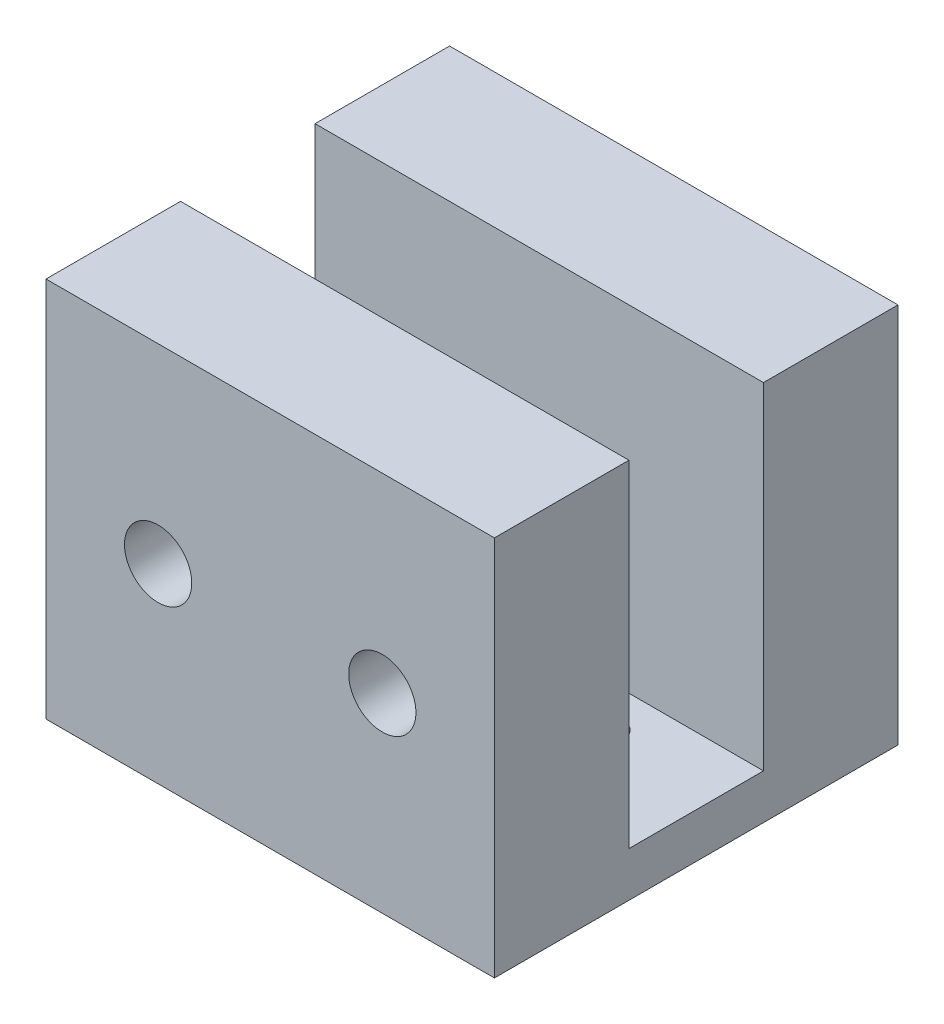
ISO-10303-21;
HEADER;
FILE_DESCRIPTION(('STEP AP214'),'2;1');
FILE_NAME('part.step','',(''),(''),'','','');
FILE_SCHEMA(('AUTOMOTIVE_DESIGN { 1 0 10303 214 1 1 1 1 }'));
ENDSEC;
DATA;
#1=APPLICATION_CONTEXT('core data for automotive mechanical design processes');
#2=APPLICATION_PROTOCOL_DEFINITION('international standard','automotive_design',2000,#1);
#3=PRODUCT_CONTEXT('',#1,'mechanical');
#4=PRODUCT('Part','Part','',(#3));
#5=PRODUCT_RELATED_PRODUCT_CATEGORY('part','',(#4));
#6=PRODUCT_DEFINITION_FORMATION('','',#4);
#7=PRODUCT_DEFINITION_CONTEXT('part definition',#1,'design');
#8=PRODUCT_DEFINITION('design','',#6,#7);
#9=PRODUCT_DEFINITION_SHAPE('','',#8);
#10=(LENGTH_UNIT() NAMED_UNIT(*) SI_UNIT(.MILLI.,.METRE.));
#11=(NAMED_UNIT(*) PLANE_ANGLE_UNIT() SI_UNIT($,.RADIAN.));
#12=(NAMED_UNIT(*) SI_UNIT($,.STERADIAN.) SOLID_ANGLE_UNIT());
#13=UNCERTAINTY_MEASURE_WITH_UNIT(LENGTH_MEASURE(1.E-05),#10,'distance_accuracy_value','');
#14=(GEOMETRIC_REPRESENTATION_CONTEXT(3) GLOBAL_UNCERTAINTY_ASSIGNED_CONTEXT((#13)) GLOBAL_UNIT_ASSIGNED_CONTEXT((#10,
#11,#12)) REPRESENTATION_CONTEXT('',''));
#15=CARTESIAN_POINT('',(0.,0.,0.));
#16=DIRECTION('',(0.,0.,1.));
#17=DIRECTION('',(1.,0.,0.));
#18=AXIS2_PLACEMENT_3D('',#15,#16,#17);
#19=CARTESIAN_POINT('',(10.,2.,0.));
#20=DIRECTION('',(-1.,0.,0.));
#21=DIRECTION('',(0.,0.,1.));
#22=AXIS2_PLACEMENT_3D('',#19,#20,#21);
#23=PLANE('',#22);
#24=DIRECTION('',(0.,0.,-1.));
#25=VECTOR('',#24,1.);
#26=CARTESIAN_POINT('',(10.,0.,0.));
#27=LINE('',#26,#25);
#28=CARTESIAN_POINT('',(10.,0.,9.));
#29=VERTEX_POINT('',#28);
#30=CARTESIAN_POINT('',(10.,0.,-9.));
#31=VERTEX_POINT('',#30);
#32=EDGE_CURVE('E187',#29,#31,#27,.T.);
#33=ORIENTED_EDGE('',*,*,#32,.T.);
#34=DIRECTION('',(0.,-1.,0.));
#35=VECTOR('',#34,1.);
#36=CARTESIAN_POINT('',(10.,17.,-9.));
#37=LINE('',#36,#35);
#38=CARTESIAN_POINT('',(10.,17.,-9.));
#39=VERTEX_POINT('',#38);
#40=EDGE_CURVE('E103',#39,#31,#37,.T.);
#41=ORIENTED_EDGE('',*,*,#40,.F.);
#42=DIRECTION('',(0.,0.,-1.));
#43=VECTOR('',#42,1.);
#44=CARTESIAN_POINT('',(10.,17.,0.));
#45=LINE('',#44,#43);
#46=CARTESIAN_POINT('',(10.,17.,-3.));
#47=VERTEX_POINT('',#46);
#48=EDGE_CURVE('E98',#47,#39,#45,.T.);
#49=ORIENTED_EDGE('',*,*,#48,.F.);
#50=DIRECTION('',(0.,-1.,0.));
#51=VECTOR('',#50,1.);
#52=CARTESIAN_POINT('',(10.,17.,-3.));
#53=LINE('',#52,#51);
#54=CARTESIAN_POINT('',(10.,2.,-3.));
#55=VERTEX_POINT('',#54);
#56=EDGE_CURVE('E101',#47,#55,#53,.T.);
#57=ORIENTED_EDGE('',*,*,#56,.T.);
#58=DIRECTION('',(0.,0.,-1.));
#59=VECTOR('',#58,1.);
#60=CARTESIAN_POINT('',(10.,2.,0.));
#61=LINE('',#60,#59);
#62=CARTESIAN_POINT('',(10.,2.,3.));
#63=VERTEX_POINT('',#62);
#64=EDGE_CURVE('E56',#63,#55,#61,.T.);
#65=ORIENTED_EDGE('',*,*,#64,.F.);
#66=DIRECTION('',(0.,-1.,0.));
#67=VECTOR('',#66,1.);
#68=CARTESIAN_POINT('',(10.,17.,3.));
#69=LINE('',#68,#67);
#70=CARTESIAN_POINT('',(10.,17.,3.));
#71=VERTEX_POINT('',#70);
#72=EDGE_CURVE('E189',#71,#63,#69,.T.);
#73=ORIENTED_EDGE('',*,*,#72,.F.);
#74=DIRECTION('',(0.,0.,-1.));
#75=VECTOR('',#74,1.);
#76=CARTESIAN_POINT('',(10.,17.,0.));
#77=LINE('',#76,#75);
#78=CARTESIAN_POINT('',(10.,17.,9.));
#79=VERTEX_POINT('',#78);
#80=EDGE_CURVE('E123',#79,#71,#77,.T.);
#81=ORIENTED_EDGE('',*,*,#80,.F.);
#82=DIRECTION('',(0.,-1.,0.));
#83=VECTOR('',#82,1.);
#84=CARTESIAN_POINT('',(10.,17.,9.));
#85=LINE('',#84,#83);
#86=EDGE_CURVE('E195',#79,#29,#85,.T.);
#87=ORIENTED_EDGE('',*,*,#86,.T.);
#88=EDGE_LOOP('',(#33,#41,#49,#57,#65,#73,#81,#87));
#89=FACE_BOUND('',#88,.T.);
#90=ADVANCED_FACE('F35',(#89),#23,.F.);
#91=CARTESIAN_POINT('',(-10.,2.,0.));
#92=DIRECTION('',(-1.,0.,0.));
#93=DIRECTION('',(0.,0.,1.));
#94=AXIS2_PLACEMENT_3D('',#91,#92,#93);
#95=PLANE('',#94);
#96=DIRECTION('',(0.,0.,-1.));
#97=VECTOR('',#96,1.);
#98=CARTESIAN_POINT('',(-10.,0.,0.));
#99=LINE('',#98,#97);
#100=CARTESIAN_POINT('',(-10.,0.,9.));
#101=VERTEX_POINT('',#100);
#102=CARTESIAN_POINT('',(-10.,0.,-9.));
#103=VERTEX_POINT('',#102);
#104=EDGE_CURVE('E142',#101,#103,#99,.T.);
#105=ORIENTED_EDGE('',*,*,#104,.F.);
#106=DIRECTION('',(0.,-1.,0.));
#107=VECTOR('',#106,1.);
#108=CARTESIAN_POINT('',(-10.,17.,9.));
#109=LINE('',#108,#107);
#110=CARTESIAN_POINT('',(-10.,17.,9.));
#111=VERTEX_POINT('',#110);
#112=EDGE_CURVE('E197',#111,#101,#109,.T.);
#113=ORIENTED_EDGE('',*,*,#112,.F.);
#114=DIRECTION('',(0.,0.,-1.));
#115=VECTOR('',#114,1.);
#116=CARTESIAN_POINT('',(-10.,17.,0.));
#117=LINE('',#116,#115);
#118=CARTESIAN_POINT('',(-10.,17.,3.));
#119=VERTEX_POINT('',#118);
#120=EDGE_CURVE('E203',#111,#119,#117,.T.);
#121=ORIENTED_EDGE('',*,*,#120,.T.);
#122=DIRECTION('',(0.,-1.,0.));
#123=VECTOR('',#122,1.);
#124=CARTESIAN_POINT('',(-10.,17.,3.));
#125=LINE('',#124,#123);
#126=CARTESIAN_POINT('',(-10.,2.,3.));
#127=VERTEX_POINT('',#126);
#128=EDGE_CURVE('E201',#119,#127,#125,.T.);
#129=ORIENTED_EDGE('',*,*,#128,.T.);
#130=DIRECTION('',(0.,0.,-1.));
#131=VECTOR('',#130,1.);
#132=CARTESIAN_POINT('',(-10.,2.,0.));
#133=LINE('',#132,#131);
#134=CARTESIAN_POINT('',(-10.,2.,-3.));
#135=VERTEX_POINT('',#134);
#136=EDGE_CURVE('E11',#127,#135,#133,.T.);
#137=ORIENTED_EDGE('',*,*,#136,.T.);
#138=DIRECTION('',(0.,-1.,0.));
#139=VECTOR('',#138,1.);
#140=CARTESIAN_POINT('',(-10.,17.,-3.));
#141=LINE('',#140,#139);
#142=CARTESIAN_POINT('',(-10.,17.,-3.));
#143=VERTEX_POINT('',#142);
#144=EDGE_CURVE('E130',#143,#135,#141,.T.);
#145=ORIENTED_EDGE('',*,*,#144,.F.);
#146=DIRECTION('',(0.,0.,-1.));
#147=VECTOR('',#146,1.);
#148=CARTESIAN_POINT('',(-10.,17.,0.));
#149=LINE('',#148,#147);
#150=CARTESIAN_POINT('',(-10.,17.,-9.));
#151=VERTEX_POINT('',#150);
#152=EDGE_CURVE('E114',#143,#151,#149,.T.);
#153=ORIENTED_EDGE('',*,*,#152,.T.);
#154=DIRECTION('',(0.,-1.,0.));
#155=VECTOR('',#154,1.);
#156=CARTESIAN_POINT('',(-10.,17.,-9.));
#157=LINE('',#156,#155);
#158=EDGE_CURVE('E125',#151,#103,#157,.T.);
#159=ORIENTED_EDGE('',*,*,#158,.T.);
#160=EDGE_LOOP('',(#105,#113,#121,#129,#137,#145,#153,#159));
#161=FACE_BOUND('',#160,.T.);
#162=ADVANCED_FACE('F141',(#161),#95,.T.);
#163=CARTESIAN_POINT('',(0.,2.,0.));
#164=DIRECTION('',(0.,1.,0.));
#165=DIRECTION('',(0.,0.,1.));
#166=AXIS2_PLACEMENT_3D('',#163,#164,#165);
#167=PLANE('',#166);
#168=CARTESIAN_POINT('',(4.85,2.,-0.999999999999999));
#169=DIRECTION('',(0.,1.,0.));
#170=DIRECTION('',(0.,0.,1.));
#171=AXIS2_PLACEMENT_3D('',#168,#169,#170);
#172=CIRCLE('',#171,0.85);
#173=CARTESIAN_POINT('',(4.85,2.,-0.149999999999999));
#174=VERTEX_POINT('',#173);
#175=EDGE_CURVE('E171',#174,#174,#172,.F.);
#176=ORIENTED_EDGE('',*,*,#175,.T.);
#177=EDGE_LOOP('',(#176));
#178=FACE_BOUND('',#177,.T.);
#179=CARTESIAN_POINT('',(-4.85,2.,-1.));
#180=DIRECTION('',(0.,1.,0.));
#181=DIRECTION('',(0.,0.,1.));
#182=AXIS2_PLACEMENT_3D('',#179,#180,#181);
#183=CIRCLE('',#182,0.85);
#184=CARTESIAN_POINT('',(-4.85,2.,-0.15));
#185=VERTEX_POINT('',#184);
#186=EDGE_CURVE('E165',#185,#185,#183,.F.);
#187=ORIENTED_EDGE('',*,*,#186,.T.);
#188=EDGE_LOOP('',(#187));
#189=FACE_BOUND('',#188,.T.);
#190=DIRECTION('',(-1.,0.,0.));
#191=VECTOR('',#190,1.);
#192=CARTESIAN_POINT('',(0.,2.,3.));
#193=LINE('',#192,#191);
#194=EDGE_CURVE('E217',#63,#127,#193,.T.);
#195=ORIENTED_EDGE('',*,*,#194,.F.);
#196=ORIENTED_EDGE('',*,*,#64,.T.);
#197=DIRECTION('',(1.,0.,0.));
#198=VECTOR('',#197,1.);
#199=CARTESIAN_POINT('',(0.,2.,-3.));
#200=LINE('',#199,#198);
#201=EDGE_CURVE('E38',#135,#55,#200,.T.);
#202=ORIENTED_EDGE('',*,*,#201,.F.);
#203=ORIENTED_EDGE('',*,*,#136,.F.);
#204=EDGE_LOOP('',(#195,#196,#202,#203));
#205=FACE_BOUND('',#204,.T.);
#206=ADVANCED_FACE('F183',(#178,#189,#205),#167,.T.);
#207=CARTESIAN_POINT('',(0.,0.,0.));
#208=DIRECTION('',(0.,1.,0.));
#209=DIRECTION('',(0.,0.,1.));
#210=AXIS2_PLACEMENT_3D('',#207,#208,#209);
#211=PLANE('',#210);
#212=CARTESIAN_POINT('',(4.85,0.,-0.999999999999999));
#213=DIRECTION('',(0.,-1.,0.));
#214=DIRECTION('',(0.,0.,-1.));
#215=AXIS2_PLACEMENT_3D('',#212,#213,#214);
#216=CIRCLE('',#215,0.85);
#217=CARTESIAN_POINT('',(4.85,0.,-1.85));
#218=VERTEX_POINT('',#217);
#219=EDGE_CURVE('E168',#218,#218,#216,.T.);
#220=ORIENTED_EDGE('',*,*,#219,.F.);
#221=EDGE_LOOP('',(#220));
#222=FACE_BOUND('',#221,.T.);
#223=CARTESIAN_POINT('',(-4.85,0.,-1.));
#224=DIRECTION('',(0.,-1.,0.));
#225=DIRECTION('',(0.,0.,-1.));
#226=AXIS2_PLACEMENT_3D('',#223,#224,#225);
#227=CIRCLE('',#226,0.85);
#228=CARTESIAN_POINT('',(-4.85,0.,-1.85));
#229=VERTEX_POINT('',#228);
#230=EDGE_CURVE('E162',#229,#229,#227,.T.);
#231=ORIENTED_EDGE('',*,*,#230,.F.);
#232=EDGE_LOOP('',(#231));
#233=FACE_BOUND('',#232,.T.);
#234=ORIENTED_EDGE('',*,*,#32,.F.);
#235=DIRECTION('',(1.,0.,0.));
#236=VECTOR('',#235,1.);
#237=CARTESIAN_POINT('',(0.,0.,9.));
#238=LINE('',#237,#236);
#239=EDGE_CURVE('E120',#101,#29,#238,.T.);
#240=ORIENTED_EDGE('',*,*,#239,.F.);
#241=ORIENTED_EDGE('',*,*,#104,.T.);
#242=DIRECTION('',(1.,0.,0.));
#243=VECTOR('',#242,1.);
#244=CARTESIAN_POINT('',(0.,0.,-9.));
#245=LINE('',#244,#243);
#246=EDGE_CURVE('E117',#103,#31,#245,.T.);
#247=ORIENTED_EDGE('',*,*,#246,.T.);
#248=EDGE_LOOP('',(#234,#240,#241,#247));
#249=FACE_BOUND('',#248,.T.);
#250=ADVANCED_FACE('F179',(#222,#233,#249),#211,.F.);
#251=CARTESIAN_POINT('',(0.,17.,3.));
#252=DIRECTION('',(0.,0.,1.));
#253=DIRECTION('',(1.,0.,0.));
#254=AXIS2_PLACEMENT_3D('',#251,#252,#253);
#255=PLANE('',#254);
#256=CARTESIAN_POINT('',(4.99999999999999,8.5,3.));
#257=DIRECTION('',(0.,0.,1.));
#258=DIRECTION('',(1.,0.,0.));
#259=AXIS2_PLACEMENT_3D('',#256,#257,#258);
#260=CIRCLE('',#259,1.5);
#261=CARTESIAN_POINT('',(6.49999999999999,8.5,3.));
#262=VERTEX_POINT('',#261);
#263=EDGE_CURVE('E155',#262,#262,#260,.F.);
#264=ORIENTED_EDGE('',*,*,#263,.F.);
#265=EDGE_LOOP('',(#264));
#266=FACE_BOUND('',#265,.T.);
#267=CARTESIAN_POINT('',(-5.00000000000001,8.5,3.));
#268=DIRECTION('',(0.,0.,1.));
#269=DIRECTION('',(1.,0.,0.));
#270=AXIS2_PLACEMENT_3D('',#267,#268,#269);
#271=CIRCLE('',#270,1.5);
#272=CARTESIAN_POINT('',(-3.50000000000001,8.5,3.));
#273=VERTEX_POINT('',#272);
#274=EDGE_CURVE('E148',#273,#273,#271,.F.);
#275=ORIENTED_EDGE('',*,*,#274,.F.);
#276=EDGE_LOOP('',(#275));
#277=FACE_BOUND('',#276,.T.);
#278=ORIENTED_EDGE('',*,*,#72,.T.);
#279=ORIENTED_EDGE('',*,*,#194,.T.);
#280=ORIENTED_EDGE('',*,*,#128,.F.);
#281=DIRECTION('',(-1.,0.,0.));
#282=VECTOR('',#281,1.);
#283=CARTESIAN_POINT('',(0.,17.,3.));
#284=LINE('',#283,#282);
#285=EDGE_CURVE('E225',#71,#119,#284,.T.);
#286=ORIENTED_EDGE('',*,*,#285,.F.);
#287=EDGE_LOOP('',(#278,#279,#280,#286));
#288=FACE_BOUND('',#287,.T.);
#289=ADVANCED_FACE('F182',(#266,#277,#288),#255,.F.);
#290=CARTESIAN_POINT('',(0.,17.,9.));
#291=DIRECTION('',(0.,0.,-1.));
#292=DIRECTION('',(-1.,0.,0.));
#293=AXIS2_PLACEMENT_3D('',#290,#291,#292);
#294=PLANE('',#293);
#295=CARTESIAN_POINT('',(4.99999999999999,8.5,9.));
#296=DIRECTION('',(0.,0.,1.));
#297=DIRECTION('',(1.,0.,0.));
#298=AXIS2_PLACEMENT_3D('',#295,#296,#297);
#299=CIRCLE('',#298,1.5);
#300=CARTESIAN_POINT('',(6.49999999999999,8.5,9.));
#301=VERTEX_POINT('',#300);
#302=EDGE_CURVE('E158',#301,#301,#299,.T.);
#303=ORIENTED_EDGE('',*,*,#302,.F.);
#304=EDGE_LOOP('',(#303));
#305=FACE_BOUND('',#304,.T.);
#306=CARTESIAN_POINT('',(-5.00000000000001,8.5,9.));
#307=DIRECTION('',(0.,0.,1.));
#308=DIRECTION('',(1.,0.,0.));
#309=AXIS2_PLACEMENT_3D('',#306,#307,#308);
#310=CIRCLE('',#309,1.5);
#311=CARTESIAN_POINT('',(-3.50000000000001,8.5,9.));
#312=VERTEX_POINT('',#311);
#313=EDGE_CURVE('E150',#312,#312,#310,.T.);
#314=ORIENTED_EDGE('',*,*,#313,.F.);
#315=EDGE_LOOP('',(#314));
#316=FACE_BOUND('',#315,.T.);
#317=ORIENTED_EDGE('',*,*,#239,.T.);
#318=ORIENTED_EDGE('',*,*,#86,.F.);
#319=DIRECTION('',(1.,0.,0.));
#320=VECTOR('',#319,1.);
#321=CARTESIAN_POINT('',(0.,17.,9.));
#322=LINE('',#321,#320);
#323=EDGE_CURVE('E199',#111,#79,#322,.T.);
#324=ORIENTED_EDGE('',*,*,#323,.F.);
#325=ORIENTED_EDGE('',*,*,#112,.T.);
#326=EDGE_LOOP('',(#317,#318,#324,#325));
#327=FACE_BOUND('',#326,.T.);
#328=ADVANCED_FACE('F193',(#305,#316,#327),#294,.F.);
#329=CARTESIAN_POINT('',(0.,17.,0.));
#330=DIRECTION('',(0.,1.,0.));
#331=DIRECTION('',(0.,0.,1.));
#332=AXIS2_PLACEMENT_3D('',#329,#330,#331);
#333=PLANE('',#332);
#334=ORIENTED_EDGE('',*,*,#80,.T.);
#335=ORIENTED_EDGE('',*,*,#285,.T.);
#336=ORIENTED_EDGE('',*,*,#120,.F.);
#337=ORIENTED_EDGE('',*,*,#323,.T.);
#338=EDGE_LOOP('',(#334,#335,#336,#337));
#339=FACE_BOUND('',#338,.T.);
#340=ADVANCED_FACE('F229',(#339),#333,.T.);
#341=CARTESIAN_POINT('',(0.,17.,-3.));
#342=DIRECTION('',(0.,0.,-1.));
#343=DIRECTION('',(-1.,0.,0.));
#344=AXIS2_PLACEMENT_3D('',#341,#342,#343);
#345=PLANE('',#344);
#346=ORIENTED_EDGE('',*,*,#144,.T.);
#347=ORIENTED_EDGE('',*,*,#201,.T.);
#348=ORIENTED_EDGE('',*,*,#56,.F.);
#349=DIRECTION('',(1.,0.,0.));
#350=VECTOR('',#349,1.);
#351=CARTESIAN_POINT('',(0.,17.,-3.));
#352=LINE('',#351,#350);
#353=EDGE_CURVE('E108',#143,#47,#352,.T.);
#354=ORIENTED_EDGE('',*,*,#353,.F.);
#355=EDGE_LOOP('',(#346,#347,#348,#354));
#356=FACE_BOUND('',#355,.T.);
#357=ADVANCED_FACE('F119',(#356),#345,.F.);
#358=CARTESIAN_POINT('',(0.,17.,-9.));
#359=DIRECTION('',(0.,0.,-1.));
#360=DIRECTION('',(-1.,0.,0.));
#361=AXIS2_PLACEMENT_3D('',#358,#359,#360);
#362=PLANE('',#361);
#363=ORIENTED_EDGE('',*,*,#246,.F.);
#364=ORIENTED_EDGE('',*,*,#158,.F.);
#365=DIRECTION('',(1.,0.,0.));
#366=VECTOR('',#365,1.);
#367=CARTESIAN_POINT('',(0.,17.,-9.));
#368=LINE('',#367,#366);
#369=EDGE_CURVE('E107',#151,#39,#368,.T.);
#370=ORIENTED_EDGE('',*,*,#369,.T.);
#371=ORIENTED_EDGE('',*,*,#40,.T.);
#372=EDGE_LOOP('',(#363,#364,#370,#371));
#373=FACE_BOUND('',#372,.T.);
#374=ADVANCED_FACE('F146',(#373),#362,.T.);
#375=CARTESIAN_POINT('',(0.,17.,0.));
#376=DIRECTION('',(0.,1.,0.));
#377=DIRECTION('',(0.,0.,1.));
#378=AXIS2_PLACEMENT_3D('',#375,#376,#377);
#379=PLANE('',#378);
#380=ORIENTED_EDGE('',*,*,#353,.T.);
#381=ORIENTED_EDGE('',*,*,#48,.T.);
#382=ORIENTED_EDGE('',*,*,#369,.F.);
#383=ORIENTED_EDGE('',*,*,#152,.F.);
#384=EDGE_LOOP('',(#380,#381,#382,#383));
#385=FACE_BOUND('',#384,.T.);
#386=ADVANCED_FACE('F112',(#385),#379,.T.);
#387=CARTESIAN_POINT('',(-5.00000000000001,8.5,-9.001));
#388=DIRECTION('',(0.,0.,1.));
#389=DIRECTION('',(1.,0.,0.));
#390=AXIS2_PLACEMENT_3D('',#387,#388,#389);
#391=CYLINDRICAL_SURFACE('',#390,1.5);
#392=ORIENTED_EDGE('',*,*,#313,.T.);
#393=EDGE_LOOP('',(#392));
#394=FACE_BOUND('',#393,.T.);
#395=ORIENTED_EDGE('',*,*,#274,.T.);
#396=EDGE_LOOP('',(#395));
#397=FACE_BOUND('',#396,.T.);
#398=ADVANCED_FACE('F260',(#394,#397),#391,.F.);
#399=CARTESIAN_POINT('',(4.99999999999999,8.5,-9.001));
#400=DIRECTION('',(0.,0.,1.));
#401=DIRECTION('',(1.,0.,0.));
#402=AXIS2_PLACEMENT_3D('',#399,#400,#401);
#403=CYLINDRICAL_SURFACE('',#402,1.5);
#404=ORIENTED_EDGE('',*,*,#302,.T.);
#405=EDGE_LOOP('',(#404));
#406=FACE_BOUND('',#405,.T.);
#407=ORIENTED_EDGE('',*,*,#263,.T.);
#408=EDGE_LOOP('',(#407));
#409=FACE_BOUND('',#408,.T.);
#410=ADVANCED_FACE('F257',(#406,#409),#403,.F.);
#411=CARTESIAN_POINT('',(-4.85,17.001025,-1.));
#412=DIRECTION('',(0.,-1.,0.));
#413=DIRECTION('',(0.,0.,-1.));
#414=AXIS2_PLACEMENT_3D('',#411,#412,#413);
#415=CYLINDRICAL_SURFACE('',#414,0.85);
#416=ORIENTED_EDGE('',*,*,#186,.F.);
#417=EDGE_LOOP('',(#416));
#418=FACE_BOUND('',#417,.T.);
#419=ORIENTED_EDGE('',*,*,#230,.T.);
#420=EDGE_LOOP('',(#419));
#421=FACE_BOUND('',#420,.T.);
#422=ADVANCED_FACE('F259',(#418,#421),#415,.F.);
#423=CARTESIAN_POINT('',(4.85,17.001025,-0.999999999999999));
#424=DIRECTION('',(0.,-1.,0.));
#425=DIRECTION('',(0.,0.,-1.));
#426=AXIS2_PLACEMENT_3D('',#423,#424,#425);
#427=CYLINDRICAL_SURFACE('',#426,0.85);
#428=ORIENTED_EDGE('',*,*,#175,.F.);
#429=EDGE_LOOP('',(#428));
#430=FACE_BOUND('',#429,.T.);
#431=ORIENTED_EDGE('',*,*,#219,.T.);
#432=EDGE_LOOP('',(#431));
#433=FACE_BOUND('',#432,.T.);
#434=ADVANCED_FACE('F177',(#430,#433),#427,.F.);
#435=CLOSED_SHELL('',(#90,#162,#206,#250,#289,#328,#340,#357,#374,#386,#398,#410,#422,#434));
#436=MANIFOLD_SOLID_BREP('B2',#435);
#437=ADVANCED_BREP_SHAPE_REPRESENTATION('',(#18,#436),#14);
#438=SHAPE_DEFINITION_REPRESENTATION(#9,#437);
ENDSEC;
END-ISO-10303-21;
